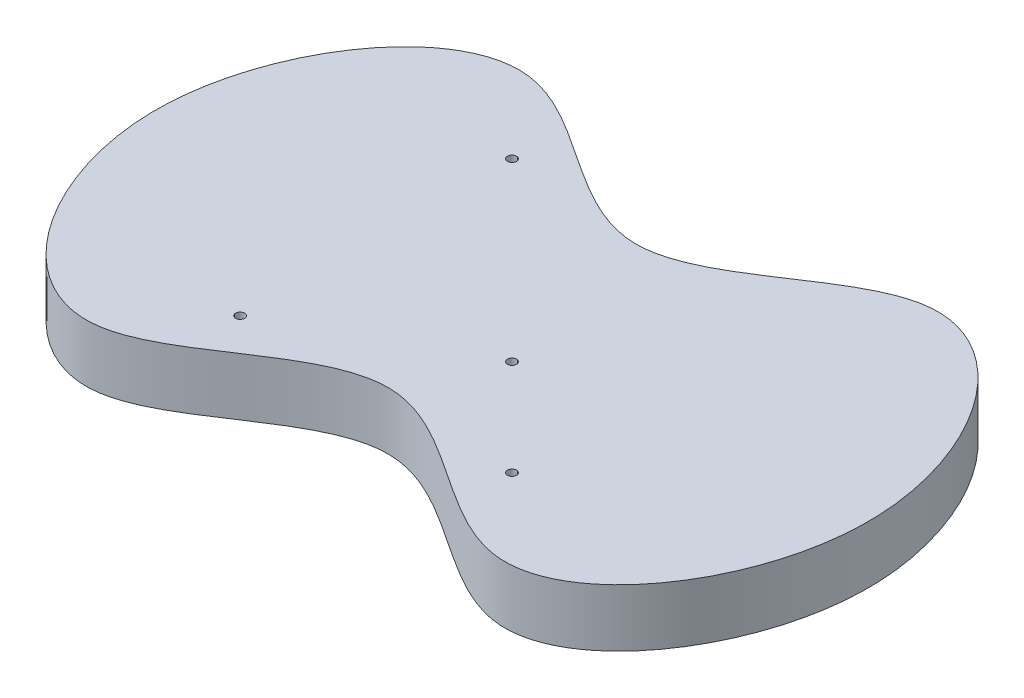
ISO-10303-21;
HEADER;
FILE_DESCRIPTION(('STEP AP214'),'2;1');
FILE_NAME('part.step','',(''),(''),'','','');
FILE_SCHEMA(('AUTOMOTIVE_DESIGN { 1 0 10303 214 1 1 1 1 }'));
ENDSEC;
DATA;
#1=APPLICATION_CONTEXT('core data for automotive mechanical design processes');
#2=APPLICATION_PROTOCOL_DEFINITION('international standard','automotive_design',2000,#1);
#3=PRODUCT_CONTEXT('',#1,'mechanical');
#4=PRODUCT('Part','Part','',(#3));
#5=PRODUCT_RELATED_PRODUCT_CATEGORY('part','',(#4));
#6=PRODUCT_DEFINITION_FORMATION('','',#4);
#7=PRODUCT_DEFINITION_CONTEXT('part definition',#1,'design');
#8=PRODUCT_DEFINITION('design','',#6,#7);
#9=PRODUCT_DEFINITION_SHAPE('','',#8);
#10=(LENGTH_UNIT() NAMED_UNIT(*) SI_UNIT(.MILLI.,.METRE.));
#11=(NAMED_UNIT(*) PLANE_ANGLE_UNIT() SI_UNIT($,.RADIAN.));
#12=(NAMED_UNIT(*) SI_UNIT($,.STERADIAN.) SOLID_ANGLE_UNIT());
#13=UNCERTAINTY_MEASURE_WITH_UNIT(LENGTH_MEASURE(1.E-05),#10,'distance_accuracy_value','');
#14=(GEOMETRIC_REPRESENTATION_CONTEXT(3) GLOBAL_UNCERTAINTY_ASSIGNED_CONTEXT((#13)) GLOBAL_UNIT_ASSIGNED_CONTEXT((#10,
#11,#12)) REPRESENTATION_CONTEXT('',''));
#15=CARTESIAN_POINT('',(0.,0.,0.));
#16=DIRECTION('',(0.,0.,1.));
#17=DIRECTION('',(1.,0.,0.));
#18=AXIS2_PLACEMENT_3D('',#15,#16,#17);
#19=CARTESIAN_POINT('',(0.,0.,27.3790177027652));
#20=DIRECTION('',(0.,1.,0.));
#21=DIRECTION('',(0.,0.,1.));
#22=AXIS2_PLACEMENT_3D('',#19,#20,#21);
#23=PLANE('',#22);
#24=CARTESIAN_POINT('',(-30.,0.,30.));
#25=DIRECTION('',(0.,1.,0.));
#26=DIRECTION('',(0.,0.,1.));
#27=AXIS2_PLACEMENT_3D('',#24,#25,#26);
#28=CIRCLE('',#27,0.999999999999998);
#29=CARTESIAN_POINT('',(-30.,0.,31.));
#30=VERTEX_POINT('',#29);
#31=EDGE_CURVE('E70',#30,#30,#28,.T.);
#32=ORIENTED_EDGE('',*,*,#31,.T.);
#33=EDGE_LOOP('',(#32));
#34=FACE_BOUND('',#33,.T.);
#35=CARTESIAN_POINT('',(-30.,0.,-30.));
#36=DIRECTION('',(0.,1.,0.));
#37=DIRECTION('',(0.,0.,1.));
#38=AXIS2_PLACEMENT_3D('',#35,#36,#37);
#39=CIRCLE('',#38,0.999999999999998);
#40=CARTESIAN_POINT('',(-30.,0.,-29.));
#41=VERTEX_POINT('',#40);
#42=EDGE_CURVE('E55',#41,#41,#39,.T.);
#43=ORIENTED_EDGE('',*,*,#42,.T.);
#44=EDGE_LOOP('',(#43));
#45=FACE_BOUND('',#44,.T.);
#46=CARTESIAN_POINT('',(0.,0.,-27.3790177027652));
#47=CARTESIAN_POINT('',(-15.2054247114993,0.,-27.3790177027652));
#48=CARTESIAN_POINT('',(-48.3901721335935,0.,-69.6252942540726));
#49=CARTESIAN_POINT('',(-95.028597807956,0.,0.));
#50=CARTESIAN_POINT('',(-48.3901721335935,0.,69.6252942540726));
#51=CARTESIAN_POINT('',(0.,0.,8.02155298346482));
#52=CARTESIAN_POINT('',(48.3901721335935,0.,69.6252942540726));
#53=CARTESIAN_POINT('',(95.028597807956,0.,0.));
#54=CARTESIAN_POINT('',(48.3901721335935,0.,-69.6252942540726));
#55=CARTESIAN_POINT('',(15.2054247114993,0.,-27.3790177027652));
#56=CARTESIAN_POINT('',(0.,0.,-27.3790177027652));
#57=B_SPLINE_CURVE_WITH_KNOTS('',3,(#46,#47,#48,#49,#50,#51,#52,#53,#54,#55,#56),.UNSPECIFIED.,
.T.,.F.,(4,1,1,1,1,1,1,1,4),(0.,0.114551306644688,0.25,0.385448693355312,0.5,0.614551306644688,
0.75,0.885448693355312,1.),.UNSPECIFIED.);
#58=CARTESIAN_POINT('',(0.,0.,-27.3790177027652));
#59=VERTEX_POINT('',#58);
#60=EDGE_CURVE('E41',#59,#59,#57,.T.);
#61=ORIENTED_EDGE('',*,*,#60,.F.);
#62=EDGE_LOOP('',(#61));
#63=FACE_BOUND('',#62,.T.);
#64=CARTESIAN_POINT('',(30.,0.,30.));
#65=DIRECTION('',(0.,1.,0.));
#66=DIRECTION('',(0.,0.,1.));
#67=AXIS2_PLACEMENT_3D('',#64,#65,#66);
#68=CIRCLE('',#67,0.999999999999998);
#69=CARTESIAN_POINT('',(30.,0.,31.));
#70=VERTEX_POINT('',#69);
#71=EDGE_CURVE('E64',#70,#70,#68,.T.);
#72=ORIENTED_EDGE('',*,*,#71,.T.);
#73=EDGE_LOOP('',(#72));
#74=FACE_BOUND('',#73,.T.);
#75=CARTESIAN_POINT('',(8.78679656440357,0.,8.78679656440358));
#76=DIRECTION('',(0.,1.,0.));
#77=DIRECTION('',(0.,0.,1.));
#78=AXIS2_PLACEMENT_3D('',#75,#76,#77);
#79=CIRCLE('',#78,1.);
#80=CARTESIAN_POINT('',(8.78679656440357,0.,9.78679656440358));
#81=VERTEX_POINT('',#80);
#82=EDGE_CURVE('E76',#81,#81,#79,.T.);
#83=ORIENTED_EDGE('',*,*,#82,.T.);
#84=EDGE_LOOP('',(#83));
#85=FACE_BOUND('',#84,.T.);
#86=ADVANCED_FACE('F31',(#34,#45,#63,#74,#85),#23,.F.);
#87=CARTESIAN_POINT('',(0.,12.7,0.));
#88=DIRECTION('',(0.,1.,0.));
#89=DIRECTION('',(0.,0.,1.));
#90=AXIS2_PLACEMENT_3D('',#87,#88,#89);
#91=PLANE('',#90);
#92=CARTESIAN_POINT('',(-30.,12.7,30.));
#93=DIRECTION('',(0.,1.,0.));
#94=DIRECTION('',(0.,0.,1.));
#95=AXIS2_PLACEMENT_3D('',#92,#93,#94);
#96=CIRCLE('',#95,0.999999999999998);
#97=CARTESIAN_POINT('',(-30.,12.7,31.));
#98=VERTEX_POINT('',#97);
#99=EDGE_CURVE('E67',#98,#98,#96,.T.);
#100=ORIENTED_EDGE('',*,*,#99,.F.);
#101=EDGE_LOOP('',(#100));
#102=FACE_BOUND('',#101,.T.);
#103=CARTESIAN_POINT('',(-30.,12.7,-30.));
#104=DIRECTION('',(0.,1.,0.));
#105=DIRECTION('',(0.,0.,1.));
#106=AXIS2_PLACEMENT_3D('',#103,#104,#105);
#107=CIRCLE('',#106,0.999999999999998);
#108=CARTESIAN_POINT('',(-30.,12.7,-29.));
#109=VERTEX_POINT('',#108);
#110=EDGE_CURVE('E45',#109,#109,#107,.T.);
#111=ORIENTED_EDGE('',*,*,#110,.F.);
#112=EDGE_LOOP('',(#111));
#113=FACE_BOUND('',#112,.T.);
#114=CARTESIAN_POINT('',(0.,12.7,-27.3790177027652));
#115=CARTESIAN_POINT('',(-15.2054247114993,12.7,-27.3790177027652));
#116=CARTESIAN_POINT('',(-48.3901721335935,12.7,-69.6252942540726));
#117=CARTESIAN_POINT('',(-95.028597807956,12.7,0.));
#118=CARTESIAN_POINT('',(-48.3901721335935,12.7,69.6252942540726));
#119=CARTESIAN_POINT('',(0.,12.7,8.02155298346482));
#120=CARTESIAN_POINT('',(48.3901721335935,12.7,69.6252942540726));
#121=CARTESIAN_POINT('',(95.028597807956,12.7,0.));
#122=CARTESIAN_POINT('',(48.3901721335935,12.7,-69.6252942540726));
#123=CARTESIAN_POINT('',(15.2054247114993,12.7,-27.3790177027652));
#124=CARTESIAN_POINT('',(0.,12.7,-27.3790177027652));
#125=B_SPLINE_CURVE_WITH_KNOTS('',3,(#114,#115,#116,#117,#118,#119,#120,#121,#122,#123,#124),
.UNSPECIFIED.,.T.,.F.,(4,1,1,1,1,1,1,1,4),(0.,0.114551306644688,0.25,0.385448693355312,0.5,
0.614551306644688,0.75,0.885448693355312,1.),.UNSPECIFIED.);
#126=CARTESIAN_POINT('',(0.,12.7,-27.3790177027652));
#127=VERTEX_POINT('',#126);
#128=EDGE_CURVE('E10',#127,#127,#125,.T.);
#129=ORIENTED_EDGE('',*,*,#128,.T.);
#130=EDGE_LOOP('',(#129));
#131=FACE_BOUND('',#130,.T.);
#132=CARTESIAN_POINT('',(30.,12.7,30.));
#133=DIRECTION('',(0.,1.,0.));
#134=DIRECTION('',(0.,0.,1.));
#135=AXIS2_PLACEMENT_3D('',#132,#133,#134);
#136=CIRCLE('',#135,0.999999999999998);
#137=CARTESIAN_POINT('',(30.,12.7,31.));
#138=VERTEX_POINT('',#137);
#139=EDGE_CURVE('E61',#138,#138,#136,.T.);
#140=ORIENTED_EDGE('',*,*,#139,.F.);
#141=EDGE_LOOP('',(#140));
#142=FACE_BOUND('',#141,.T.);
#143=CARTESIAN_POINT('',(8.78679656440357,12.7,8.78679656440358));
#144=DIRECTION('',(0.,1.,0.));
#145=DIRECTION('',(0.,0.,1.));
#146=AXIS2_PLACEMENT_3D('',#143,#144,#145);
#147=CIRCLE('',#146,1.);
#148=CARTESIAN_POINT('',(8.78679656440357,12.7,9.78679656440358));
#149=VERTEX_POINT('',#148);
#150=EDGE_CURVE('E73',#149,#149,#147,.T.);
#151=ORIENTED_EDGE('',*,*,#150,.F.);
#152=EDGE_LOOP('',(#151));
#153=FACE_BOUND('',#152,.T.);
#154=ADVANCED_FACE('F33',(#102,#113,#131,#142,#153),#91,.T.);
#155=CARTESIAN_POINT('',(0.,197.316086843129,-27.3790177027652));
#156=CARTESIAN_POINT('',(-15.2054247114993,197.316086843129,-27.3790177027652));
#157=CARTESIAN_POINT('',(-48.3901721335935,197.316086843129,-69.6252942540726));
#158=CARTESIAN_POINT('',(-95.028597807956,197.316086843129,0.));
#159=CARTESIAN_POINT('',(-48.3901721335935,197.316086843129,69.6252942540726));
#160=CARTESIAN_POINT('',(0.,197.316086843129,8.02155298346482));
#161=CARTESIAN_POINT('',(48.3901721335935,197.316086843129,69.6252942540726));
#162=CARTESIAN_POINT('',(95.028597807956,197.316086843129,0.));
#163=CARTESIAN_POINT('',(48.3901721335935,197.316086843129,-69.6252942540726));
#164=CARTESIAN_POINT('',(15.2054247114993,197.316086843129,-27.3790177027652));
#165=CARTESIAN_POINT('',(0.,197.316086843129,-27.3790177027652));
#166=B_SPLINE_CURVE_WITH_KNOTS('',3,(#155,#156,#157,#158,#159,#160,#161,#162,#163,#164,#165),
.UNSPECIFIED.,.T.,.F.,(4,1,1,1,1,1,1,1,4),(0.,0.114551306644688,0.25,0.385448693355312,0.5,
0.614551306644688,0.75,0.885448693355312,1.),.UNSPECIFIED.);
#167=DIRECTION('',(0.,-1.,0.));
#168=VECTOR('',#167,1.);
#169=SURFACE_OF_LINEAR_EXTRUSION('',#166,#168);
#170=ORIENTED_EDGE('',*,*,#60,.T.);
#171=EDGE_LOOP('',(#170));
#172=FACE_BOUND('',#171,.T.);
#173=ORIENTED_EDGE('',*,*,#128,.F.);
#174=EDGE_LOOP('',(#173));
#175=FACE_BOUND('',#174,.T.);
#176=ADVANCED_FACE('F86',(#172,#175),#169,.F.);
#177=CARTESIAN_POINT('',(-30.,12.7,-30.));
#178=DIRECTION('',(0.,-1.,0.));
#179=DIRECTION('',(0.,0.,-1.));
#180=AXIS2_PLACEMENT_3D('',#177,#178,#179);
#181=CYLINDRICAL_SURFACE('',#180,0.999999999999998);
#182=ORIENTED_EDGE('',*,*,#110,.T.);
#183=EDGE_LOOP('',(#182));
#184=FACE_BOUND('',#183,.T.);
#185=ORIENTED_EDGE('',*,*,#42,.F.);
#186=EDGE_LOOP('',(#185));
#187=FACE_BOUND('',#186,.T.);
#188=ADVANCED_FACE('F92',(#184,#187),#181,.F.);
#189=CARTESIAN_POINT('',(30.,12.7,30.));
#190=DIRECTION('',(0.,-1.,0.));
#191=DIRECTION('',(0.,0.,-1.));
#192=AXIS2_PLACEMENT_3D('',#189,#190,#191);
#193=CYLINDRICAL_SURFACE('',#192,0.999999999999998);
#194=ORIENTED_EDGE('',*,*,#139,.T.);
#195=EDGE_LOOP('',(#194));
#196=FACE_BOUND('',#195,.T.);
#197=ORIENTED_EDGE('',*,*,#71,.F.);
#198=EDGE_LOOP('',(#197));
#199=FACE_BOUND('',#198,.T.);
#200=ADVANCED_FACE('F102',(#196,#199),#193,.F.);
#201=CARTESIAN_POINT('',(-30.,12.7,30.));
#202=DIRECTION('',(0.,-1.,0.));
#203=DIRECTION('',(0.,0.,-1.));
#204=AXIS2_PLACEMENT_3D('',#201,#202,#203);
#205=CYLINDRICAL_SURFACE('',#204,0.999999999999998);
#206=ORIENTED_EDGE('',*,*,#99,.T.);
#207=EDGE_LOOP('',(#206));
#208=FACE_BOUND('',#207,.T.);
#209=ORIENTED_EDGE('',*,*,#31,.F.);
#210=EDGE_LOOP('',(#209));
#211=FACE_BOUND('',#210,.T.);
#212=ADVANCED_FACE('F105',(#208,#211),#205,.F.);
#213=CARTESIAN_POINT('',(8.78679656440357,12.7,8.78679656440358));
#214=DIRECTION('',(0.,-1.,0.));
#215=DIRECTION('',(0.,0.,-1.));
#216=AXIS2_PLACEMENT_3D('',#213,#214,#215);
#217=CYLINDRICAL_SURFACE('',#216,1.);
#218=ORIENTED_EDGE('',*,*,#150,.T.);
#219=EDGE_LOOP('',(#218));
#220=FACE_BOUND('',#219,.T.);
#221=ORIENTED_EDGE('',*,*,#82,.F.);
#222=EDGE_LOOP('',(#221));
#223=FACE_BOUND('',#222,.T.);
#224=ADVANCED_FACE('F82',(#220,#223),#217,.F.);
#225=CLOSED_SHELL('',(#86,#154,#176,#188,#200,#212,#224));
#226=MANIFOLD_SOLID_BREP('B2',#225);
#227=ADVANCED_BREP_SHAPE_REPRESENTATION('',(#18,#226),#14);
#228=SHAPE_DEFINITION_REPRESENTATION(#9,#227);
ENDSEC;
END-ISO-10303-21;
